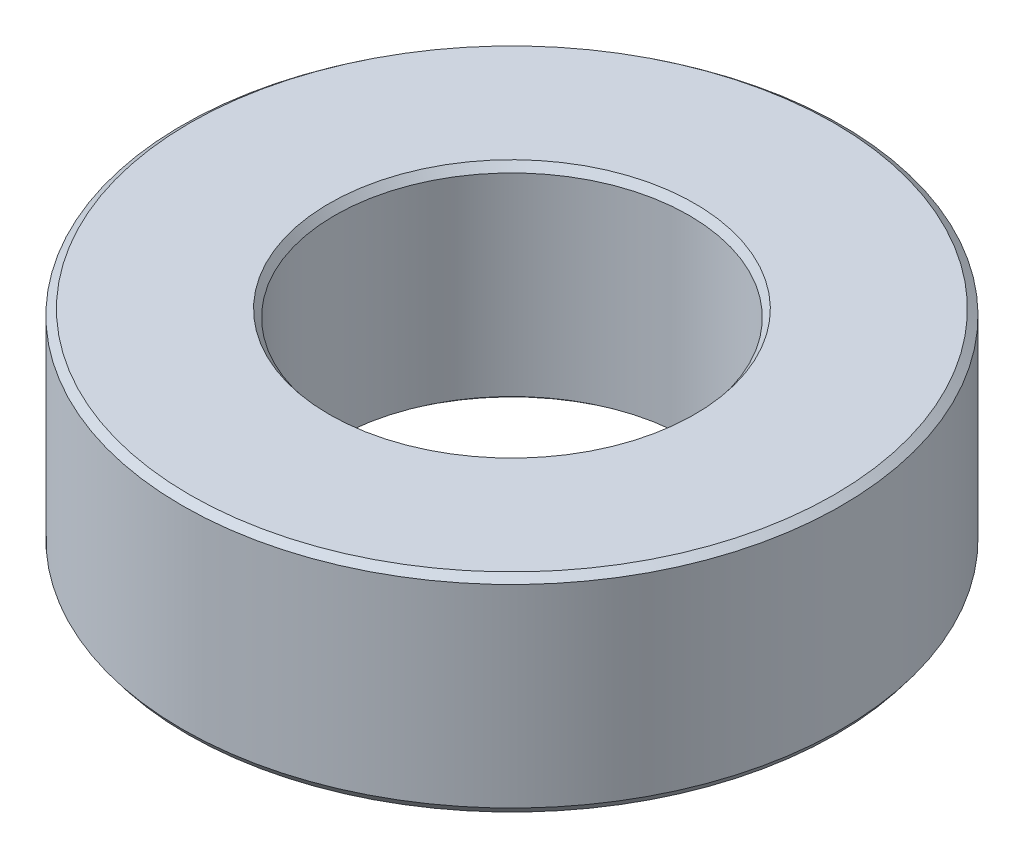
ISO-10303-21;
HEADER;
FILE_DESCRIPTION(('STEP AP214'),'2;1');
FILE_NAME('part.step','',(''),(''),'','','');
FILE_SCHEMA(('AUTOMOTIVE_DESIGN { 1 0 10303 214 1 1 1 1 }'));
ENDSEC;
DATA;
#1=APPLICATION_CONTEXT('core data for automotive mechanical design processes');
#2=APPLICATION_PROTOCOL_DEFINITION('international standard','automotive_design',2000,#1);
#3=PRODUCT_CONTEXT('',#1,'mechanical');
#4=PRODUCT('Part','Part','',(#3));
#5=PRODUCT_RELATED_PRODUCT_CATEGORY('part','',(#4));
#6=PRODUCT_DEFINITION_FORMATION('','',#4);
#7=PRODUCT_DEFINITION_CONTEXT('part definition',#1,'design');
#8=PRODUCT_DEFINITION('design','',#6,#7);
#9=PRODUCT_DEFINITION_SHAPE('','',#8);
#10=(LENGTH_UNIT() NAMED_UNIT(*) SI_UNIT(.MILLI.,.METRE.));
#11=(NAMED_UNIT(*) PLANE_ANGLE_UNIT() SI_UNIT($,.RADIAN.));
#12=(NAMED_UNIT(*) SI_UNIT($,.STERADIAN.) SOLID_ANGLE_UNIT());
#13=UNCERTAINTY_MEASURE_WITH_UNIT(LENGTH_MEASURE(1.E-05),#10,'distance_accuracy_value','');
#14=(GEOMETRIC_REPRESENTATION_CONTEXT(3) GLOBAL_UNCERTAINTY_ASSIGNED_CONTEXT((#13)) GLOBAL_UNIT_ASSIGNED_CONTEXT((#10,
#11,#12)) REPRESENTATION_CONTEXT('',''));
#15=CARTESIAN_POINT('',(0.,0.,0.));
#16=DIRECTION('',(0.,0.,1.));
#17=DIRECTION('',(1.,0.,0.));
#18=AXIS2_PLACEMENT_3D('',#15,#16,#17);
#19=CARTESIAN_POINT('',(0.,36.0683509143461,0.));
#20=DIRECTION('',(0.,-1.,0.));
#21=DIRECTION('',(0.,0.,-1.));
#22=AXIS2_PLACEMENT_3D('',#19,#20,#21);
#23=CYLINDRICAL_SURFACE('',#22,57.5);
#24=CARTESIAN_POINT('',(0.,1.30334207980316,0.));
#25=DIRECTION('',(0.,1.,0.));
#26=DIRECTION('',(0.,0.,1.));
#27=AXIS2_PLACEMENT_3D('',#24,#25,#26);
#28=CIRCLE('',#27,57.5);
#29=CARTESIAN_POINT('',(0.,1.30334207980316,57.5));
#30=VERTEX_POINT('',#29);
#31=EDGE_CURVE('E10',#30,#30,#28,.T.);
#32=ORIENTED_EDGE('',*,*,#31,.T.);
#33=EDGE_LOOP('',(#32));
#34=FACE_BOUND('',#33,.T.);
#35=CARTESIAN_POINT('',(0.,35.0812328201467,0.));
#36=DIRECTION('',(0.,1.,0.));
#37=DIRECTION('',(0.,0.,1.));
#38=AXIS2_PLACEMENT_3D('',#35,#36,#37);
#39=CIRCLE('',#38,57.5);
#40=CARTESIAN_POINT('',(0.,35.0812328201467,57.5));
#41=VERTEX_POINT('',#40);
#42=EDGE_CURVE('E50',#41,#41,#39,.F.);
#43=ORIENTED_EDGE('',*,*,#42,.T.);
#44=EDGE_LOOP('',(#43));
#45=FACE_BOUND('',#44,.T.);
#46=ADVANCED_FACE('F39',(#34,#45),#23,.T.);
#47=CARTESIAN_POINT('',(0.,36.0683509143461,0.));
#48=DIRECTION('',(0.,1.,0.));
#49=DIRECTION('',(0.,0.,1.));
#50=AXIS2_PLACEMENT_3D('',#47,#48,#49);
#51=PLANE('',#50);
#52=CARTESIAN_POINT('',(0.,36.0683509143461,0.));
#53=DIRECTION('',(0.,1.,0.));
#54=DIRECTION('',(0.,0.,1.));
#55=AXIS2_PLACEMENT_3D('',#52,#53,#54);
#56=CIRCLE('',#55,31.884072348622);
#57=CARTESIAN_POINT('',(0.,36.0683509143461,31.884072348622));
#58=VERTEX_POINT('',#57);
#59=EDGE_CURVE('E58',#58,#58,#56,.F.);
#60=ORIENTED_EDGE('',*,*,#59,.T.);
#61=EDGE_LOOP('',(#60));
#62=FACE_BOUND('',#61,.T.);
#63=CARTESIAN_POINT('',(0.,36.0683509143461,0.));
#64=DIRECTION('',(0.,1.,0.));
#65=DIRECTION('',(0.,0.,1.));
#66=AXIS2_PLACEMENT_3D('',#63,#64,#65);
#67=CIRCLE('',#66,56.1966579201968);
#68=CARTESIAN_POINT('',(0.,36.0683509143461,56.1966579201968));
#69=VERTEX_POINT('',#68);
#70=EDGE_CURVE('E61',#69,#69,#67,.T.);
#71=ORIENTED_EDGE('',*,*,#70,.T.);
#72=EDGE_LOOP('',(#71));
#73=FACE_BOUND('',#72,.T.);
#74=ADVANCED_FACE('F88',(#62,#73),#51,.T.);
#75=CARTESIAN_POINT('',(0.,0.,0.));
#76=DIRECTION('',(0.,1.,0.));
#77=DIRECTION('',(0.,0.,1.));
#78=AXIS2_PLACEMENT_3D('',#75,#76,#77);
#79=PLANE('',#78);
#80=CARTESIAN_POINT('',(0.,0.,0.));
#81=DIRECTION('',(0.,1.,0.));
#82=DIRECTION('',(0.,0.,1.));
#83=AXIS2_PLACEMENT_3D('',#80,#81,#82);
#84=CIRCLE('',#83,32.2002963342258);
#85=CARTESIAN_POINT('',(0.,0.,32.2002963342258));
#86=VERTEX_POINT('',#85);
#87=EDGE_CURVE('E51',#86,#86,#84,.T.);
#88=ORIENTED_EDGE('',*,*,#87,.T.);
#89=EDGE_LOOP('',(#88));
#90=FACE_BOUND('',#89,.T.);
#91=CARTESIAN_POINT('',(0.,0.,0.));
#92=DIRECTION('',(0.,1.,0.));
#93=DIRECTION('',(0.,0.,1.));
#94=AXIS2_PLACEMENT_3D('',#91,#92,#93);
#95=CIRCLE('',#94,56.5128819058006);
#96=CARTESIAN_POINT('',(0.,0.,56.5128819058006));
#97=VERTEX_POINT('',#96);
#98=EDGE_CURVE('E54',#97,#97,#95,.F.);
#99=ORIENTED_EDGE('',*,*,#98,.T.);
#100=EDGE_LOOP('',(#99));
#101=FACE_BOUND('',#100,.T.);
#102=ADVANCED_FACE('F83',(#90,#101),#79,.F.);
#103=CARTESIAN_POINT('',(0.,36.0683509143461,0.));
#104=DIRECTION('',(0.,-1.,0.));
#105=DIRECTION('',(0.,0.,-1.));
#106=AXIS2_PLACEMENT_3D('',#103,#104,#105);
#107=CYLINDRICAL_SURFACE('',#106,30.8969542544226);
#108=CARTESIAN_POINT('',(0.,34.7650088345429,0.));
#109=DIRECTION('',(0.,1.,0.));
#110=DIRECTION('',(0.,0.,1.));
#111=AXIS2_PLACEMENT_3D('',#108,#109,#110);
#112=CIRCLE('',#111,30.8969542544226);
#113=CARTESIAN_POINT('',(0.,34.7650088345429,30.8969542544226));
#114=VERTEX_POINT('',#113);
#115=EDGE_CURVE('E67',#114,#114,#112,.T.);
#116=ORIENTED_EDGE('',*,*,#115,.T.);
#117=EDGE_LOOP('',(#116));
#118=FACE_BOUND('',#117,.T.);
#119=CARTESIAN_POINT('',(0.,0.987118094199386,0.));
#120=DIRECTION('',(0.,1.,0.));
#121=DIRECTION('',(0.,0.,1.));
#122=AXIS2_PLACEMENT_3D('',#119,#120,#121);
#123=CIRCLE('',#122,30.8969542544226);
#124=CARTESIAN_POINT('',(0.,0.987118094199386,30.8969542544226));
#125=VERTEX_POINT('',#124);
#126=EDGE_CURVE('E69',#125,#125,#123,.F.);
#127=ORIENTED_EDGE('',*,*,#126,.T.);
#128=EDGE_LOOP('',(#127));
#129=FACE_BOUND('',#128,.T.);
#130=ADVANCED_FACE('F71',(#118,#129),#107,.F.);
#131=CARTESIAN_POINT('',(0.,34.7650088345429,0.));
#132=DIRECTION('',(0.,1.,0.));
#133=DIRECTION('',(0.,0.,1.));
#134=AXIS2_PLACEMENT_3D('',#131,#132,#133);
#135=CONICAL_SURFACE('',#134,30.8969542544226,0.648204125128525);
#136=ORIENTED_EDGE('',*,*,#59,.F.);
#137=EDGE_LOOP('',(#136));
#138=FACE_BOUND('',#137,.T.);
#139=ORIENTED_EDGE('',*,*,#115,.F.);
#140=EDGE_LOOP('',(#139));
#141=FACE_BOUND('',#140,.T.);
#142=ADVANCED_FACE('F77',(#138,#141),#135,.F.);
#143=CARTESIAN_POINT('',(0.,0.,0.));
#144=DIRECTION('',(0.,-1.,0.));
#145=DIRECTION('',(0.,0.,-1.));
#146=AXIS2_PLACEMENT_3D('',#143,#144,#145);
#147=CONICAL_SURFACE('',#146,32.2002963342258,0.92259220166637);
#148=ORIENTED_EDGE('',*,*,#126,.F.);
#149=EDGE_LOOP('',(#148));
#150=FACE_BOUND('',#149,.T.);
#151=ORIENTED_EDGE('',*,*,#87,.F.);
#152=EDGE_LOOP('',(#151));
#153=FACE_BOUND('',#152,.T.);
#154=ADVANCED_FACE('F73',(#150,#153),#147,.F.);
#155=CARTESIAN_POINT('',(0.,1.30334207980316,0.));
#156=DIRECTION('',(0.,1.,0.));
#157=DIRECTION('',(0.,0.,1.));
#158=AXIS2_PLACEMENT_3D('',#155,#156,#157);
#159=CONICAL_SURFACE('',#158,57.5,0.648204125128525);
#160=ORIENTED_EDGE('',*,*,#98,.F.);
#161=EDGE_LOOP('',(#160));
#162=FACE_BOUND('',#161,.T.);
#163=ORIENTED_EDGE('',*,*,#31,.F.);
#164=EDGE_LOOP('',(#163));
#165=FACE_BOUND('',#164,.T.);
#166=ADVANCED_FACE('F76',(#162,#165),#159,.T.);
#167=CARTESIAN_POINT('',(0.,36.0683509143461,0.));
#168=DIRECTION('',(0.,-1.,0.));
#169=DIRECTION('',(0.,0.,-1.));
#170=AXIS2_PLACEMENT_3D('',#167,#168,#169);
#171=CONICAL_SURFACE('',#170,56.1966579201968,0.922592201666362);
#172=ORIENTED_EDGE('',*,*,#42,.F.);
#173=EDGE_LOOP('',(#172));
#174=FACE_BOUND('',#173,.T.);
#175=ORIENTED_EDGE('',*,*,#70,.F.);
#176=EDGE_LOOP('',(#175));
#177=FACE_BOUND('',#176,.T.);
#178=ADVANCED_FACE('F45',(#174,#177),#171,.T.);
#179=CLOSED_SHELL('',(#46,#74,#102,#130,#142,#154,#166,#178));
#180=MANIFOLD_SOLID_BREP('B2',#179);
#181=ADVANCED_BREP_SHAPE_REPRESENTATION('',(#18,#180),#14);
#182=SHAPE_DEFINITION_REPRESENTATION(#9,#181);
ENDSEC;
END-ISO-10303-21;
